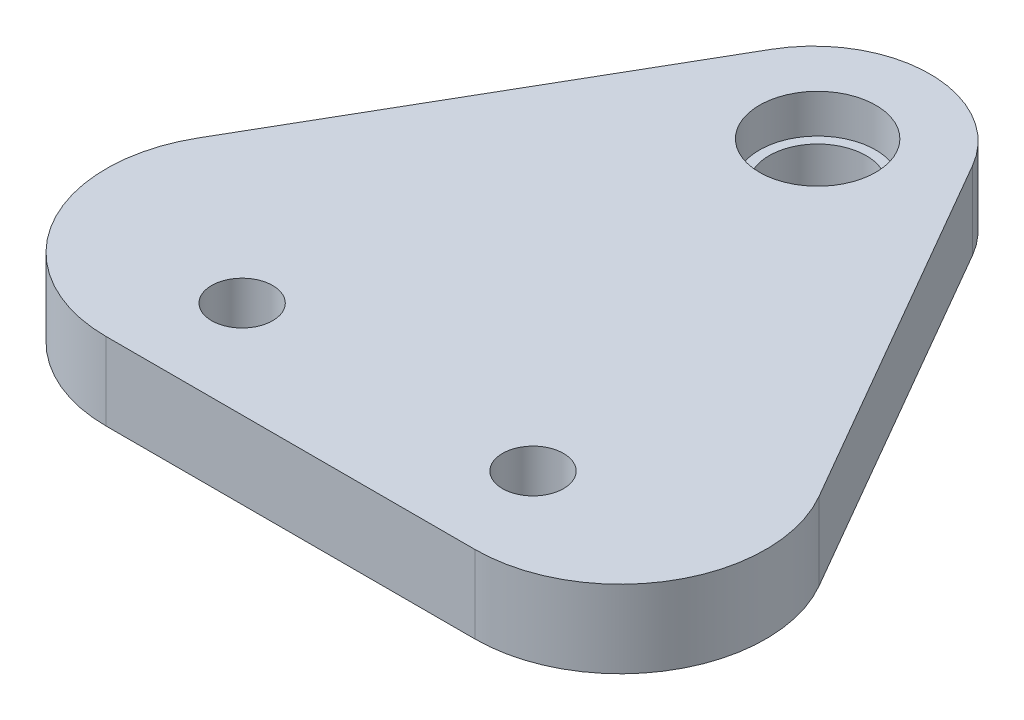
ISO-10303-21;
HEADER;
FILE_DESCRIPTION(('STEP AP214'),'2;1');
FILE_NAME('part.step','',(''),(''),'','','');
FILE_SCHEMA(('AUTOMOTIVE_DESIGN { 1 0 10303 214 1 1 1 1 }'));
ENDSEC;
DATA;
#1=APPLICATION_CONTEXT('core data for automotive mechanical design processes');
#2=APPLICATION_PROTOCOL_DEFINITION('international standard','automotive_design',2000,#1);
#3=PRODUCT_CONTEXT('',#1,'mechanical');
#4=PRODUCT('Part','Part','',(#3));
#5=PRODUCT_RELATED_PRODUCT_CATEGORY('part','',(#4));
#6=PRODUCT_DEFINITION_FORMATION('','',#4);
#7=PRODUCT_DEFINITION_CONTEXT('part definition',#1,'design');
#8=PRODUCT_DEFINITION('design','',#6,#7);
#9=PRODUCT_DEFINITION_SHAPE('','',#8);
#10=(LENGTH_UNIT() NAMED_UNIT(*) SI_UNIT(.MILLI.,.METRE.));
#11=(NAMED_UNIT(*) PLANE_ANGLE_UNIT() SI_UNIT($,.RADIAN.));
#12=(NAMED_UNIT(*) SI_UNIT($,.STERADIAN.) SOLID_ANGLE_UNIT());
#13=UNCERTAINTY_MEASURE_WITH_UNIT(LENGTH_MEASURE(1.E-05),#10,'distance_accuracy_value','');
#14=(GEOMETRIC_REPRESENTATION_CONTEXT(3) GLOBAL_UNCERTAINTY_ASSIGNED_CONTEXT((#13)) GLOBAL_UNIT_ASSIGNED_CONTEXT((#10,
#11,#12)) REPRESENTATION_CONTEXT('',''));
#15=CARTESIAN_POINT('',(0.,0.,0.));
#16=DIRECTION('',(0.,0.,1.));
#17=DIRECTION('',(1.,0.,0.));
#18=AXIS2_PLACEMENT_3D('',#15,#16,#17);
#19=CARTESIAN_POINT('',(44.9999999999999,8.,-53.9422863405996));
#20=DIRECTION('',(0.,1.,0.));
#21=DIRECTION('',(0.,0.,1.));
#22=AXIS2_PLACEMENT_3D('',#19,#20,#21);
#23=PLANE('',#22);
#24=CARTESIAN_POINT('',(44.9999999999999,8.,-53.9422863405996));
#25=DIRECTION('',(0.,1.,0.));
#26=DIRECTION('',(0.,0.,1.));
#27=AXIS2_PLACEMENT_3D('',#24,#25,#26);
#28=CIRCLE('',#27,12.);
#29=CARTESIAN_POINT('',(55.3923048454132,8.,-59.9422863405995));
#30=VERTEX_POINT('',#29);
#31=CARTESIAN_POINT('',(34.6076951545865,8.,-59.9422863405994));
#32=VERTEX_POINT('',#31);
#33=EDGE_CURVE('E129',#30,#32,#28,.T.);
#34=ORIENTED_EDGE('',*,*,#33,.T.);
#35=DIRECTION('',(-0.499999999999998,0.,0.86602540378444));
#36=VECTOR('',#35,1.);
#37=CARTESIAN_POINT('',(12.9903810567666,8.,-22.5000000000002));
#38=LINE('',#37,#36);
#39=CARTESIAN_POINT('',(12.9903810567666,8.,-22.5000000000002));
#40=VERTEX_POINT('',#39);
#41=EDGE_CURVE('E87',#32,#40,#38,.T.);
#42=ORIENTED_EDGE('',*,*,#41,.T.);
#43=CARTESIAN_POINT('',(25.9807621135331,8.,-15.));
#44=DIRECTION('',(0.,1.,0.));
#45=DIRECTION('',(0.,0.,-1.));
#46=AXIS2_PLACEMENT_3D('',#43,#44,#45);
#47=CIRCLE('',#46,15.);
#48=CARTESIAN_POINT('',(25.9807621135333,8.,0.));
#49=VERTEX_POINT('',#48);
#50=EDGE_CURVE('E100',#40,#49,#47,.T.);
#51=ORIENTED_EDGE('',*,*,#50,.T.);
#52=DIRECTION('',(1.,0.,0.));
#53=VECTOR('',#52,1.);
#54=CARTESIAN_POINT('',(25.9807621135333,8.,0.));
#55=LINE('',#54,#53);
#56=CARTESIAN_POINT('',(64.0192378864666,8.,0.));
#57=VERTEX_POINT('',#56);
#58=EDGE_CURVE('E94',#49,#57,#55,.T.);
#59=ORIENTED_EDGE('',*,*,#58,.T.);
#60=CARTESIAN_POINT('',(64.0192378864668,8.,-15.));
#61=DIRECTION('',(0.,1.,0.));
#62=DIRECTION('',(0.,0.,1.));
#63=AXIS2_PLACEMENT_3D('',#60,#61,#62);
#64=CIRCLE('',#63,15.);
#65=CARTESIAN_POINT('',(77.0096189432333,8.,-22.5000000000002));
#66=VERTEX_POINT('',#65);
#67=EDGE_CURVE('E98',#57,#66,#64,.T.);
#68=ORIENTED_EDGE('',*,*,#67,.T.);
#69=DIRECTION('',(-0.500000000000001,0.,-0.866025403784438));
#70=VECTOR('',#69,1.);
#71=CARTESIAN_POINT('',(77.0096189432333,8.,-22.5000000000002));
#72=LINE('',#71,#70);
#73=EDGE_CURVE('E50',#66,#30,#72,.T.);
#74=ORIENTED_EDGE('',*,*,#73,.T.);
#75=EDGE_LOOP('',(#34,#42,#51,#59,#68,#74));
#76=FACE_BOUND('',#75,.T.);
#77=CARTESIAN_POINT('',(44.9999999999999,8.,-54.3581662742643));
#78=DIRECTION('',(0.,1.,0.));
#79=DIRECTION('',(0.,0.,1.));
#80=AXIS2_PLACEMENT_3D('',#77,#78,#79);
#81=CIRCLE('',#80,5.99999999999999);
#82=CARTESIAN_POINT('',(44.9999999999999,8.,-48.3581662742643));
#83=VERTEX_POINT('',#82);
#84=EDGE_CURVE('E202',#83,#83,#81,.T.);
#85=ORIENTED_EDGE('',*,*,#84,.F.);
#86=EDGE_LOOP('',(#85));
#87=FACE_BOUND('',#86,.T.);
#88=CARTESIAN_POINT('',(60.,8.,-10.));
#89=DIRECTION('',(0.,1.,0.));
#90=DIRECTION('',(0.,0.,1.));
#91=AXIS2_PLACEMENT_3D('',#88,#89,#90);
#92=CIRCLE('',#91,3.15);
#93=CARTESIAN_POINT('',(60.,8.,-6.85));
#94=VERTEX_POINT('',#93);
#95=EDGE_CURVE('E122',#94,#94,#92,.T.);
#96=ORIENTED_EDGE('',*,*,#95,.F.);
#97=EDGE_LOOP('',(#96));
#98=FACE_BOUND('',#97,.T.);
#99=CARTESIAN_POINT('',(30.,8.,-10.));
#100=DIRECTION('',(0.,1.,0.));
#101=DIRECTION('',(0.,0.,1.));
#102=AXIS2_PLACEMENT_3D('',#99,#100,#101);
#103=CIRCLE('',#102,3.15);
#104=CARTESIAN_POINT('',(30.,8.,-6.85));
#105=VERTEX_POINT('',#104);
#106=EDGE_CURVE('E184',#105,#105,#103,.F.);
#107=ORIENTED_EDGE('',*,*,#106,.T.);
#108=EDGE_LOOP('',(#107));
#109=FACE_BOUND('',#108,.T.);
#110=ADVANCED_FACE('F32',(#76,#87,#98,#109),#23,.T.);
#111=CARTESIAN_POINT('',(44.9999999999999,8.,-53.9422863405996));
#112=DIRECTION('',(0.,-1.,0.));
#113=DIRECTION('',(0.,0.,-1.));
#114=AXIS2_PLACEMENT_3D('',#111,#112,#113);
#115=CYLINDRICAL_SURFACE('',#114,12.);
#116=CARTESIAN_POINT('',(44.9999999999999,0.,-53.9422863405996));
#117=DIRECTION('',(0.,1.,0.));
#118=DIRECTION('',(0.,0.,1.));
#119=AXIS2_PLACEMENT_3D('',#116,#117,#118);
#120=CIRCLE('',#119,12.);
#121=CARTESIAN_POINT('',(55.3923048454132,0.,-59.9422863405995));
#122=VERTEX_POINT('',#121);
#123=CARTESIAN_POINT('',(34.6076951545865,0.,-59.9422863405994));
#124=VERTEX_POINT('',#123);
#125=EDGE_CURVE('E118',#122,#124,#120,.T.);
#126=ORIENTED_EDGE('',*,*,#125,.T.);
#127=DIRECTION('',(0.,-1.,0.));
#128=VECTOR('',#127,1.);
#129=CARTESIAN_POINT('',(34.6076951545865,8.,-59.9422863405994));
#130=LINE('',#129,#128);
#131=EDGE_CURVE('E11',#32,#124,#130,.T.);
#132=ORIENTED_EDGE('',*,*,#131,.F.);
#133=ORIENTED_EDGE('',*,*,#33,.F.);
#134=DIRECTION('',(0.,-1.,0.));
#135=VECTOR('',#134,1.);
#136=CARTESIAN_POINT('',(55.3923048454132,8.,-59.9422863405995));
#137=LINE('',#136,#135);
#138=EDGE_CURVE('E114',#30,#122,#137,.T.);
#139=ORIENTED_EDGE('',*,*,#138,.T.);
#140=EDGE_LOOP('',(#126,#132,#133,#139));
#141=FACE_BOUND('',#140,.T.);
#142=ADVANCED_FACE('F34',(#141),#115,.T.);
#143=CARTESIAN_POINT('',(12.9903810567666,8.,-22.5000000000002));
#144=DIRECTION('',(0.86602540378444,0.,0.499999999999998));
#145=DIRECTION('',(0.499999999999998,0.,-0.86602540378444));
#146=AXIS2_PLACEMENT_3D('',#143,#144,#145);
#147=PLANE('',#146);
#148=DIRECTION('',(-0.499999999999998,0.,0.86602540378444));
#149=VECTOR('',#148,1.);
#150=CARTESIAN_POINT('',(12.9903810567666,0.,-22.5000000000002));
#151=LINE('',#150,#149);
#152=CARTESIAN_POINT('',(12.9903810567666,0.,-22.5000000000002));
#153=VERTEX_POINT('',#152);
#154=EDGE_CURVE('E121',#124,#153,#151,.T.);
#155=ORIENTED_EDGE('',*,*,#154,.T.);
#156=DIRECTION('',(0.,-1.,0.));
#157=VECTOR('',#156,1.);
#158=CARTESIAN_POINT('',(12.9903810567666,8.,-22.5000000000002));
#159=LINE('',#158,#157);
#160=EDGE_CURVE('E42',#40,#153,#159,.T.);
#161=ORIENTED_EDGE('',*,*,#160,.F.);
#162=ORIENTED_EDGE('',*,*,#41,.F.);
#163=ORIENTED_EDGE('',*,*,#131,.T.);
#164=EDGE_LOOP('',(#155,#161,#162,#163));
#165=FACE_BOUND('',#164,.T.);
#166=ADVANCED_FACE('F159',(#165),#147,.F.);
#167=CARTESIAN_POINT('',(25.9807621135331,8.,-15.));
#168=DIRECTION('',(0.,-1.,0.));
#169=DIRECTION('',(0.,0.,-1.));
#170=AXIS2_PLACEMENT_3D('',#167,#168,#169);
#171=CYLINDRICAL_SURFACE('',#170,15.);
#172=CARTESIAN_POINT('',(25.9807621135331,0.,-15.));
#173=DIRECTION('',(0.,1.,0.));
#174=DIRECTION('',(0.,0.,-1.));
#175=AXIS2_PLACEMENT_3D('',#172,#173,#174);
#176=CIRCLE('',#175,15.);
#177=CARTESIAN_POINT('',(25.9807621135333,0.,0.));
#178=VERTEX_POINT('',#177);
#179=EDGE_CURVE('E124',#153,#178,#176,.T.);
#180=ORIENTED_EDGE('',*,*,#179,.T.);
#181=DIRECTION('',(0.,-1.,0.));
#182=VECTOR('',#181,1.);
#183=CARTESIAN_POINT('',(25.9807621135333,8.,0.));
#184=LINE('',#183,#182);
#185=EDGE_CURVE('E109',#49,#178,#184,.T.);
#186=ORIENTED_EDGE('',*,*,#185,.F.);
#187=ORIENTED_EDGE('',*,*,#50,.F.);
#188=ORIENTED_EDGE('',*,*,#160,.T.);
#189=EDGE_LOOP('',(#180,#186,#187,#188));
#190=FACE_BOUND('',#189,.T.);
#191=ADVANCED_FACE('F136',(#190),#171,.T.);
#192=CARTESIAN_POINT('',(25.9807621135333,8.,0.));
#193=DIRECTION('',(0.,0.,-1.));
#194=DIRECTION('',(-1.,0.,0.));
#195=AXIS2_PLACEMENT_3D('',#192,#193,#194);
#196=PLANE('',#195);
#197=DIRECTION('',(1.,0.,0.));
#198=VECTOR('',#197,1.);
#199=CARTESIAN_POINT('',(25.9807621135333,0.,0.));
#200=LINE('',#199,#198);
#201=CARTESIAN_POINT('',(64.0192378864666,0.,0.));
#202=VERTEX_POINT('',#201);
#203=EDGE_CURVE('E108',#178,#202,#200,.T.);
#204=ORIENTED_EDGE('',*,*,#203,.T.);
#205=DIRECTION('',(0.,-1.,0.));
#206=VECTOR('',#205,1.);
#207=CARTESIAN_POINT('',(64.0192378864666,8.,0.));
#208=LINE('',#207,#206);
#209=EDGE_CURVE('E105',#57,#202,#208,.T.);
#210=ORIENTED_EDGE('',*,*,#209,.F.);
#211=ORIENTED_EDGE('',*,*,#58,.F.);
#212=ORIENTED_EDGE('',*,*,#185,.T.);
#213=EDGE_LOOP('',(#204,#210,#211,#212));
#214=FACE_BOUND('',#213,.T.);
#215=ADVANCED_FACE('F106',(#214),#196,.F.);
#216=CARTESIAN_POINT('',(64.0192378864668,8.,-15.));
#217=DIRECTION('',(0.,-1.,0.));
#218=DIRECTION('',(0.,0.,-1.));
#219=AXIS2_PLACEMENT_3D('',#216,#217,#218);
#220=CYLINDRICAL_SURFACE('',#219,15.);
#221=CARTESIAN_POINT('',(64.0192378864668,0.,-15.));
#222=DIRECTION('',(0.,1.,0.));
#223=DIRECTION('',(0.,0.,1.));
#224=AXIS2_PLACEMENT_3D('',#221,#222,#223);
#225=CIRCLE('',#224,15.);
#226=CARTESIAN_POINT('',(77.0096189432333,0.,-22.5000000000002));
#227=VERTEX_POINT('',#226);
#228=EDGE_CURVE('E73',#202,#227,#225,.T.);
#229=ORIENTED_EDGE('',*,*,#228,.T.);
#230=DIRECTION('',(0.,-1.,0.));
#231=VECTOR('',#230,1.);
#232=CARTESIAN_POINT('',(77.0096189432333,8.,-22.5000000000002));
#233=LINE('',#232,#231);
#234=EDGE_CURVE('E110',#66,#227,#233,.T.);
#235=ORIENTED_EDGE('',*,*,#234,.F.);
#236=ORIENTED_EDGE('',*,*,#67,.F.);
#237=ORIENTED_EDGE('',*,*,#209,.T.);
#238=EDGE_LOOP('',(#229,#235,#236,#237));
#239=FACE_BOUND('',#238,.T.);
#240=ADVANCED_FACE('F112',(#239),#220,.T.);
#241=CARTESIAN_POINT('',(77.0096189432333,8.,-22.5000000000002));
#242=DIRECTION('',(-0.866025403784438,0.,0.500000000000001));
#243=DIRECTION('',(0.500000000000001,0.,0.866025403784438));
#244=AXIS2_PLACEMENT_3D('',#241,#242,#243);
#245=PLANE('',#244);
#246=DIRECTION('',(-0.500000000000001,0.,-0.866025403784438));
#247=VECTOR('',#246,1.);
#248=CARTESIAN_POINT('',(77.0096189432333,0.,-22.5000000000002));
#249=LINE('',#248,#247);
#250=EDGE_CURVE('E79',#227,#122,#249,.T.);
#251=ORIENTED_EDGE('',*,*,#250,.T.);
#252=ORIENTED_EDGE('',*,*,#138,.F.);
#253=ORIENTED_EDGE('',*,*,#73,.F.);
#254=ORIENTED_EDGE('',*,*,#234,.T.);
#255=EDGE_LOOP('',(#251,#252,#253,#254));
#256=FACE_BOUND('',#255,.T.);
#257=ADVANCED_FACE('F143',(#256),#245,.F.);
#258=CARTESIAN_POINT('',(44.9999999999999,0.,-53.9422863405996));
#259=DIRECTION('',(0.,1.,0.));
#260=DIRECTION('',(0.,0.,1.));
#261=AXIS2_PLACEMENT_3D('',#258,#259,#260);
#262=PLANE('',#261);
#263=CARTESIAN_POINT('',(30.,0.,-10.));
#264=DIRECTION('',(0.,1.,0.));
#265=DIRECTION('',(0.,0.,1.));
#266=AXIS2_PLACEMENT_3D('',#263,#264,#265);
#267=CIRCLE('',#266,3.15);
#268=CARTESIAN_POINT('',(30.,0.,-6.85));
#269=VERTEX_POINT('',#268);
#270=EDGE_CURVE('E187',#269,#269,#267,.T.);
#271=ORIENTED_EDGE('',*,*,#270,.T.);
#272=EDGE_LOOP('',(#271));
#273=FACE_BOUND('',#272,.T.);
#274=CARTESIAN_POINT('',(60.,0.,-10.));
#275=DIRECTION('',(0.,1.,0.));
#276=DIRECTION('',(0.,0.,1.));
#277=AXIS2_PLACEMENT_3D('',#274,#275,#276);
#278=CIRCLE('',#277,3.15);
#279=CARTESIAN_POINT('',(60.,0.,-6.85));
#280=VERTEX_POINT('',#279);
#281=EDGE_CURVE('E188',#280,#280,#278,.T.);
#282=ORIENTED_EDGE('',*,*,#281,.T.);
#283=EDGE_LOOP('',(#282));
#284=FACE_BOUND('',#283,.T.);
#285=CARTESIAN_POINT('',(44.9999999999999,0.,-54.3581662742643));
#286=DIRECTION('',(0.,1.,0.));
#287=DIRECTION('',(0.,0.,1.));
#288=AXIS2_PLACEMENT_3D('',#285,#286,#287);
#289=CIRCLE('',#288,5.);
#290=CARTESIAN_POINT('',(44.9999999999999,0.,-49.3581662742643));
#291=VERTEX_POINT('',#290);
#292=EDGE_CURVE('E36',#291,#291,#289,.T.);
#293=ORIENTED_EDGE('',*,*,#292,.T.);
#294=EDGE_LOOP('',(#293));
#295=FACE_BOUND('',#294,.T.);
#296=ORIENTED_EDGE('',*,*,#125,.F.);
#297=ORIENTED_EDGE('',*,*,#250,.F.);
#298=ORIENTED_EDGE('',*,*,#228,.F.);
#299=ORIENTED_EDGE('',*,*,#203,.F.);
#300=ORIENTED_EDGE('',*,*,#179,.F.);
#301=ORIENTED_EDGE('',*,*,#154,.F.);
#302=EDGE_LOOP('',(#296,#297,#298,#299,#300,#301));
#303=FACE_BOUND('',#302,.T.);
#304=ADVANCED_FACE('F139',(#273,#284,#295,#303),#262,.F.);
#305=CARTESIAN_POINT('',(44.9999999999999,4.,-54.3581662742643));
#306=DIRECTION('',(0.,1.,0.));
#307=DIRECTION('',(0.,0.,1.));
#308=AXIS2_PLACEMENT_3D('',#305,#306,#307);
#309=CYLINDRICAL_SURFACE('',#308,5.99999999999999);
#310=CARTESIAN_POINT('',(44.9999999999999,4.,-54.3581662742643));
#311=DIRECTION('',(0.,1.,0.));
#312=DIRECTION('',(0.,0.,1.));
#313=AXIS2_PLACEMENT_3D('',#310,#311,#312);
#314=CIRCLE('',#313,5.99999999999999);
#315=CARTESIAN_POINT('',(44.9999999999999,4.,-48.3581662742643));
#316=VERTEX_POINT('',#315);
#317=EDGE_CURVE('E199',#316,#316,#314,.T.);
#318=ORIENTED_EDGE('',*,*,#317,.F.);
#319=EDGE_LOOP('',(#318));
#320=FACE_BOUND('',#319,.T.);
#321=ORIENTED_EDGE('',*,*,#84,.T.);
#322=EDGE_LOOP('',(#321));
#323=FACE_BOUND('',#322,.T.);
#324=ADVANCED_FACE('F150',(#320,#323),#309,.F.);
#325=CARTESIAN_POINT('',(44.9999999999999,4.,-54.3581662742643));
#326=DIRECTION('',(0.,1.,0.));
#327=DIRECTION('',(0.,0.,1.));
#328=AXIS2_PLACEMENT_3D('',#325,#326,#327);
#329=PLANE('',#328);
#330=CARTESIAN_POINT('',(44.9999999999999,4.,-54.3581662742643));
#331=DIRECTION('',(0.,1.,0.));
#332=DIRECTION('',(0.,0.,1.));
#333=AXIS2_PLACEMENT_3D('',#330,#331,#332);
#334=CIRCLE('',#333,5.);
#335=CARTESIAN_POINT('',(44.9999999999999,4.,-49.3581662742643));
#336=VERTEX_POINT('',#335);
#337=EDGE_CURVE('E190',#336,#336,#334,.T.);
#338=ORIENTED_EDGE('',*,*,#337,.F.);
#339=EDGE_LOOP('',(#338));
#340=FACE_BOUND('',#339,.T.);
#341=ORIENTED_EDGE('',*,*,#317,.T.);
#342=EDGE_LOOP('',(#341));
#343=FACE_BOUND('',#342,.T.);
#344=ADVANCED_FACE('F163',(#340,#343),#329,.T.);
#345=CARTESIAN_POINT('',(60.,4.,-10.));
#346=DIRECTION('',(0.,1.,0.));
#347=DIRECTION('',(0.,0.,1.));
#348=AXIS2_PLACEMENT_3D('',#345,#346,#347);
#349=CYLINDRICAL_SURFACE('',#348,3.15);
#350=ORIENTED_EDGE('',*,*,#95,.T.);
#351=EDGE_LOOP('',(#350));
#352=FACE_BOUND('',#351,.T.);
#353=ORIENTED_EDGE('',*,*,#281,.F.);
#354=EDGE_LOOP('',(#353));
#355=FACE_BOUND('',#354,.T.);
#356=ADVANCED_FACE('F167',(#352,#355),#349,.F.);
#357=CARTESIAN_POINT('',(44.9999999999999,-6.,-54.3581662742643));
#358=DIRECTION('',(0.,1.,0.));
#359=DIRECTION('',(0.,0.,1.));
#360=AXIS2_PLACEMENT_3D('',#357,#358,#359);
#361=CYLINDRICAL_SURFACE('',#360,5.);
#362=ORIENTED_EDGE('',*,*,#337,.T.);
#363=EDGE_LOOP('',(#362));
#364=FACE_BOUND('',#363,.T.);
#365=ORIENTED_EDGE('',*,*,#292,.F.);
#366=EDGE_LOOP('',(#365));
#367=FACE_BOUND('',#366,.T.);
#368=ADVANCED_FACE('F171',(#364,#367),#361,.F.);
#369=CARTESIAN_POINT('',(30.,11.,-10.));
#370=DIRECTION('',(0.,-1.,0.));
#371=DIRECTION('',(0.,0.,-1.));
#372=AXIS2_PLACEMENT_3D('',#369,#370,#371);
#373=CYLINDRICAL_SURFACE('',#372,3.15);
#374=ORIENTED_EDGE('',*,*,#106,.F.);
#375=EDGE_LOOP('',(#374));
#376=FACE_BOUND('',#375,.T.);
#377=ORIENTED_EDGE('',*,*,#270,.F.);
#378=EDGE_LOOP('',(#377));
#379=FACE_BOUND('',#378,.T.);
#380=ADVANCED_FACE('F175',(#376,#379),#373,.F.);
#381=CLOSED_SHELL('',(#110,#142,#166,#191,#215,#240,#257,#304,#324,#344,#356,#368,#380));
#382=MANIFOLD_SOLID_BREP('B2',#381);
#383=ADVANCED_BREP_SHAPE_REPRESENTATION('',(#18,#382),#14);
#384=SHAPE_DEFINITION_REPRESENTATION(#9,#383);
ENDSEC;
END-ISO-10303-21;
